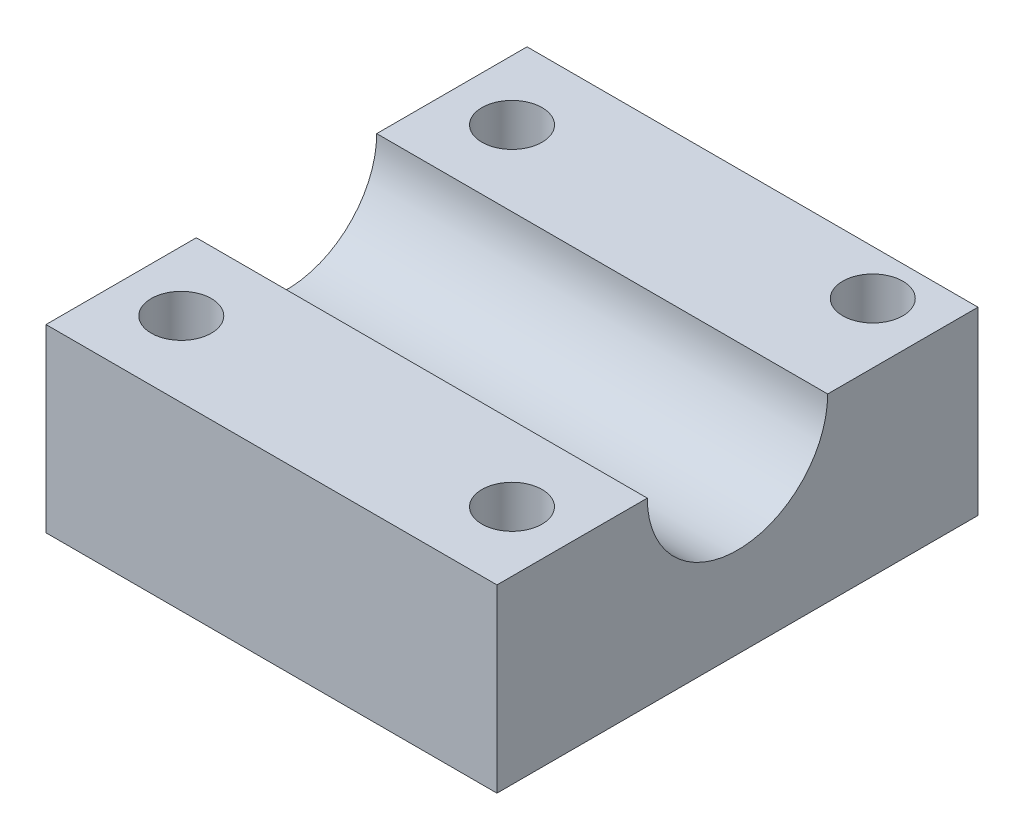
ISO-10303-21;
HEADER;
FILE_DESCRIPTION(('STEP AP214'),'2;1');
FILE_NAME('part.step','',(''),(''),'','','');
FILE_SCHEMA(('AUTOMOTIVE_DESIGN { 1 0 10303 214 1 1 1 1 }'));
ENDSEC;
DATA;
#1=APPLICATION_CONTEXT('core data for automotive mechanical design processes');
#2=APPLICATION_PROTOCOL_DEFINITION('international standard','automotive_design',2000,#1);
#3=PRODUCT_CONTEXT('',#1,'mechanical');
#4=PRODUCT('Part','Part','',(#3));
#5=PRODUCT_RELATED_PRODUCT_CATEGORY('part','',(#4));
#6=PRODUCT_DEFINITION_FORMATION('','',#4);
#7=PRODUCT_DEFINITION_CONTEXT('part definition',#1,'design');
#8=PRODUCT_DEFINITION('design','',#6,#7);
#9=PRODUCT_DEFINITION_SHAPE('','',#8);
#10=(LENGTH_UNIT() NAMED_UNIT(*) SI_UNIT(.MILLI.,.METRE.));
#11=(NAMED_UNIT(*) PLANE_ANGLE_UNIT() SI_UNIT($,.RADIAN.));
#12=(NAMED_UNIT(*) SI_UNIT($,.STERADIAN.) SOLID_ANGLE_UNIT());
#13=UNCERTAINTY_MEASURE_WITH_UNIT(LENGTH_MEASURE(1.E-05),#10,'distance_accuracy_value','');
#14=(GEOMETRIC_REPRESENTATION_CONTEXT(3) GLOBAL_UNCERTAINTY_ASSIGNED_CONTEXT((#13)) GLOBAL_UNIT_ASSIGNED_CONTEXT((#10,
#11,#12)) REPRESENTATION_CONTEXT('',''));
#15=CARTESIAN_POINT('',(0.,0.,0.));
#16=DIRECTION('',(0.,0.,1.));
#17=DIRECTION('',(1.,0.,0.));
#18=AXIS2_PLACEMENT_3D('',#15,#16,#17);
#19=CARTESIAN_POINT('',(30.,0.,0.));
#20=DIRECTION('',(0.,1.,0.));
#21=DIRECTION('',(0.,0.,1.));
#22=AXIS2_PLACEMENT_3D('',#19,#20,#21);
#23=PLANE('',#22);
#24=CARTESIAN_POINT('',(26.,0.,-5.));
#25=DIRECTION('',(0.,1.,0.));
#26=DIRECTION('',(0.,0.,1.));
#27=AXIS2_PLACEMENT_3D('',#24,#25,#26);
#28=CIRCLE('',#27,2.);
#29=CARTESIAN_POINT('',(26.,0.,-3.));
#30=VERTEX_POINT('',#29);
#31=EDGE_CURVE('E160',#30,#30,#28,.T.);
#32=ORIENTED_EDGE('',*,*,#31,.T.);
#33=EDGE_LOOP('',(#32));
#34=FACE_BOUND('',#33,.T.);
#35=CARTESIAN_POINT('',(4.,0.,-5.));
#36=DIRECTION('',(0.,1.,0.));
#37=DIRECTION('',(0.,0.,1.));
#38=AXIS2_PLACEMENT_3D('',#35,#36,#37);
#39=CIRCLE('',#38,2.);
#40=CARTESIAN_POINT('',(4.,0.,-3.));
#41=VERTEX_POINT('',#40);
#42=EDGE_CURVE('E164',#41,#41,#39,.T.);
#43=ORIENTED_EDGE('',*,*,#42,.T.);
#44=EDGE_LOOP('',(#43));
#45=FACE_BOUND('',#44,.T.);
#46=CARTESIAN_POINT('',(26.,0.,-29.));
#47=DIRECTION('',(0.,1.,0.));
#48=DIRECTION('',(0.,0.,1.));
#49=AXIS2_PLACEMENT_3D('',#46,#47,#48);
#50=CIRCLE('',#49,2.00000000000001);
#51=CARTESIAN_POINT('',(26.,0.,-27.));
#52=VERTEX_POINT('',#51);
#53=EDGE_CURVE('E168',#52,#52,#50,.T.);
#54=ORIENTED_EDGE('',*,*,#53,.T.);
#55=EDGE_LOOP('',(#54));
#56=FACE_BOUND('',#55,.T.);
#57=CARTESIAN_POINT('',(4.,0.,-27.));
#58=DIRECTION('',(0.,1.,0.));
#59=DIRECTION('',(0.,0.,1.));
#60=AXIS2_PLACEMENT_3D('',#57,#58,#59);
#61=CIRCLE('',#60,2.);
#62=CARTESIAN_POINT('',(4.,0.,-25.));
#63=VERTEX_POINT('',#62);
#64=EDGE_CURVE('E120',#63,#63,#61,.T.);
#65=ORIENTED_EDGE('',*,*,#64,.T.);
#66=EDGE_LOOP('',(#65));
#67=FACE_BOUND('',#66,.T.);
#68=DIRECTION('',(0.,0.,-1.));
#69=VECTOR('',#68,1.);
#70=CARTESIAN_POINT('',(0.,0.,0.));
#71=LINE('',#70,#69);
#72=CARTESIAN_POINT('',(0.,0.,0.));
#73=VERTEX_POINT('',#72);
#74=CARTESIAN_POINT('',(0.,0.,-32.));
#75=VERTEX_POINT('',#74);
#76=EDGE_CURVE('E116',#73,#75,#71,.T.);
#77=ORIENTED_EDGE('',*,*,#76,.T.);
#78=DIRECTION('',(-1.,0.,0.));
#79=VECTOR('',#78,1.);
#80=CARTESIAN_POINT('',(30.,0.,-32.));
#81=LINE('',#80,#79);
#82=CARTESIAN_POINT('',(30.,0.,-32.));
#83=VERTEX_POINT('',#82);
#84=EDGE_CURVE('E11',#83,#75,#81,.T.);
#85=ORIENTED_EDGE('',*,*,#84,.F.);
#86=DIRECTION('',(0.,0.,-1.));
#87=VECTOR('',#86,1.);
#88=CARTESIAN_POINT('',(30.,0.,0.));
#89=LINE('',#88,#87);
#90=CARTESIAN_POINT('',(30.,0.,0.));
#91=VERTEX_POINT('',#90);
#92=EDGE_CURVE('E127',#91,#83,#89,.T.);
#93=ORIENTED_EDGE('',*,*,#92,.F.);
#94=DIRECTION('',(-1.,0.,0.));
#95=VECTOR('',#94,1.);
#96=CARTESIAN_POINT('',(30.,0.,0.));
#97=LINE('',#96,#95);
#98=EDGE_CURVE('E112',#91,#73,#97,.T.);
#99=ORIENTED_EDGE('',*,*,#98,.T.);
#100=EDGE_LOOP('',(#77,#85,#93,#99));
#101=FACE_BOUND('',#100,.T.);
#102=ADVANCED_FACE('F32',(#34,#45,#56,#67,#101),#23,.F.);
#103=CARTESIAN_POINT('',(30.,0.,-32.));
#104=DIRECTION('',(0.,0.,1.));
#105=DIRECTION('',(1.,0.,0.));
#106=AXIS2_PLACEMENT_3D('',#103,#104,#105);
#107=PLANE('',#106);
#108=DIRECTION('',(0.,1.,0.));
#109=VECTOR('',#108,1.);
#110=CARTESIAN_POINT('',(0.,0.,-32.));
#111=LINE('',#110,#109);
#112=CARTESIAN_POINT('',(0.,12.,-32.));
#113=VERTEX_POINT('',#112);
#114=EDGE_CURVE('E119',#75,#113,#111,.T.);
#115=ORIENTED_EDGE('',*,*,#114,.T.);
#116=DIRECTION('',(-1.,0.,0.));
#117=VECTOR('',#116,1.);
#118=CARTESIAN_POINT('',(30.,12.,-32.));
#119=LINE('',#118,#117);
#120=CARTESIAN_POINT('',(30.,12.,-32.));
#121=VERTEX_POINT('',#120);
#122=EDGE_CURVE('E40',#121,#113,#119,.T.);
#123=ORIENTED_EDGE('',*,*,#122,.F.);
#124=DIRECTION('',(0.,1.,0.));
#125=VECTOR('',#124,1.);
#126=CARTESIAN_POINT('',(30.,0.,-32.));
#127=LINE('',#126,#125);
#128=EDGE_CURVE('E85',#83,#121,#127,.T.);
#129=ORIENTED_EDGE('',*,*,#128,.F.);
#130=ORIENTED_EDGE('',*,*,#84,.T.);
#131=EDGE_LOOP('',(#115,#123,#129,#130));
#132=FACE_BOUND('',#131,.T.);
#133=ADVANCED_FACE('F152',(#132),#107,.F.);
#134=CARTESIAN_POINT('',(30.,12.,-32.));
#135=DIRECTION('',(0.,-1.,0.));
#136=DIRECTION('',(0.,0.,-1.));
#137=AXIS2_PLACEMENT_3D('',#134,#135,#136);
#138=PLANE('',#137);
#139=CARTESIAN_POINT('',(26.,12.,-29.));
#140=DIRECTION('',(0.,1.,0.));
#141=DIRECTION('',(0.,0.,1.));
#142=AXIS2_PLACEMENT_3D('',#139,#140,#141);
#143=CIRCLE('',#142,2.00000000000001);
#144=CARTESIAN_POINT('',(26.,12.,-27.));
#145=VERTEX_POINT('',#144);
#146=EDGE_CURVE('E177',#145,#145,#143,.T.);
#147=ORIENTED_EDGE('',*,*,#146,.F.);
#148=EDGE_LOOP('',(#147));
#149=FACE_BOUND('',#148,.T.);
#150=CARTESIAN_POINT('',(4.,12.,-27.));
#151=DIRECTION('',(0.,1.,0.));
#152=DIRECTION('',(0.,0.,1.));
#153=AXIS2_PLACEMENT_3D('',#150,#151,#152);
#154=CIRCLE('',#153,2.);
#155=CARTESIAN_POINT('',(4.,12.,-25.));
#156=VERTEX_POINT('',#155);
#157=EDGE_CURVE('E172',#156,#156,#154,.T.);
#158=ORIENTED_EDGE('',*,*,#157,.F.);
#159=EDGE_LOOP('',(#158));
#160=FACE_BOUND('',#159,.T.);
#161=DIRECTION('',(0.,0.,1.));
#162=VECTOR('',#161,1.);
#163=CARTESIAN_POINT('',(0.,12.,-32.));
#164=LINE('',#163,#162);
#165=CARTESIAN_POINT('',(0.,12.,-22.));
#166=VERTEX_POINT('',#165);
#167=EDGE_CURVE('E122',#113,#166,#164,.T.);
#168=ORIENTED_EDGE('',*,*,#167,.T.);
#169=DIRECTION('',(-1.,0.,0.));
#170=VECTOR('',#169,1.);
#171=CARTESIAN_POINT('',(30.,12.,-22.));
#172=LINE('',#171,#170);
#173=CARTESIAN_POINT('',(30.,12.,-22.));
#174=VERTEX_POINT('',#173);
#175=EDGE_CURVE('E107',#174,#166,#172,.T.);
#176=ORIENTED_EDGE('',*,*,#175,.F.);
#177=DIRECTION('',(0.,0.,1.));
#178=VECTOR('',#177,1.);
#179=CARTESIAN_POINT('',(30.,12.,-32.));
#180=LINE('',#179,#178);
#181=EDGE_CURVE('E98',#121,#174,#180,.T.);
#182=ORIENTED_EDGE('',*,*,#181,.F.);
#183=ORIENTED_EDGE('',*,*,#122,.T.);
#184=EDGE_LOOP('',(#168,#176,#182,#183));
#185=FACE_BOUND('',#184,.T.);
#186=ADVANCED_FACE('F133',(#149,#160,#185),#138,.F.);
#187=CARTESIAN_POINT('',(30.,12.,-16.));
#188=DIRECTION('',(-1.,0.,0.));
#189=DIRECTION('',(0.,0.,1.));
#190=AXIS2_PLACEMENT_3D('',#187,#188,#189);
#191=CYLINDRICAL_SURFACE('',#190,6.);
#192=CARTESIAN_POINT('',(0.,12.,-16.));
#193=DIRECTION('',(-1.,0.,0.));
#194=DIRECTION('',(0.,0.,-1.));
#195=AXIS2_PLACEMENT_3D('',#192,#193,#194);
#196=CIRCLE('',#195,6.);
#197=CARTESIAN_POINT('',(0.,12.,-10.));
#198=VERTEX_POINT('',#197);
#199=EDGE_CURVE('E106',#166,#198,#196,.T.);
#200=ORIENTED_EDGE('',*,*,#199,.T.);
#201=DIRECTION('',(-1.,0.,0.));
#202=VECTOR('',#201,1.);
#203=CARTESIAN_POINT('',(30.,12.,-10.));
#204=LINE('',#203,#202);
#205=CARTESIAN_POINT('',(30.,12.,-10.));
#206=VERTEX_POINT('',#205);
#207=EDGE_CURVE('E103',#206,#198,#204,.T.);
#208=ORIENTED_EDGE('',*,*,#207,.F.);
#209=CARTESIAN_POINT('',(30.,12.,-16.));
#210=DIRECTION('',(-1.,0.,0.));
#211=DIRECTION('',(0.,0.,-1.));
#212=AXIS2_PLACEMENT_3D('',#209,#210,#211);
#213=CIRCLE('',#212,6.);
#214=EDGE_CURVE('E92',#174,#206,#213,.T.);
#215=ORIENTED_EDGE('',*,*,#214,.F.);
#216=ORIENTED_EDGE('',*,*,#175,.T.);
#217=EDGE_LOOP('',(#200,#208,#215,#216));
#218=FACE_BOUND('',#217,.T.);
#219=ADVANCED_FACE('F104',(#218),#191,.F.);
#220=CARTESIAN_POINT('',(30.,12.,0.));
#221=DIRECTION('',(0.,-1.,0.));
#222=DIRECTION('',(0.,0.,-1.));
#223=AXIS2_PLACEMENT_3D('',#220,#221,#222);
#224=PLANE('',#223);
#225=CARTESIAN_POINT('',(26.,12.,-5.));
#226=DIRECTION('',(0.,1.,0.));
#227=DIRECTION('',(0.,0.,1.));
#228=AXIS2_PLACEMENT_3D('',#225,#226,#227);
#229=CIRCLE('',#228,2.);
#230=CARTESIAN_POINT('',(26.,12.,-3.));
#231=VERTEX_POINT('',#230);
#232=EDGE_CURVE('E187',#231,#231,#229,.T.);
#233=ORIENTED_EDGE('',*,*,#232,.F.);
#234=EDGE_LOOP('',(#233));
#235=FACE_BOUND('',#234,.T.);
#236=CARTESIAN_POINT('',(4.,12.,-5.));
#237=DIRECTION('',(0.,1.,0.));
#238=DIRECTION('',(0.,0.,1.));
#239=AXIS2_PLACEMENT_3D('',#236,#237,#238);
#240=CIRCLE('',#239,2.);
#241=CARTESIAN_POINT('',(4.,12.,-3.));
#242=VERTEX_POINT('',#241);
#243=EDGE_CURVE('E183',#242,#242,#240,.T.);
#244=ORIENTED_EDGE('',*,*,#243,.F.);
#245=EDGE_LOOP('',(#244));
#246=FACE_BOUND('',#245,.T.);
#247=DIRECTION('',(0.,0.,1.));
#248=VECTOR('',#247,1.);
#249=CARTESIAN_POINT('',(0.,12.,0.));
#250=LINE('',#249,#248);
#251=CARTESIAN_POINT('',(0.,12.,0.));
#252=VERTEX_POINT('',#251);
#253=EDGE_CURVE('E71',#198,#252,#250,.T.);
#254=ORIENTED_EDGE('',*,*,#253,.T.);
#255=DIRECTION('',(-1.,0.,0.));
#256=VECTOR('',#255,1.);
#257=CARTESIAN_POINT('',(30.,12.,0.));
#258=LINE('',#257,#256);
#259=CARTESIAN_POINT('',(30.,12.,0.));
#260=VERTEX_POINT('',#259);
#261=EDGE_CURVE('E108',#260,#252,#258,.T.);
#262=ORIENTED_EDGE('',*,*,#261,.F.);
#263=DIRECTION('',(0.,0.,1.));
#264=VECTOR('',#263,1.);
#265=CARTESIAN_POINT('',(30.,12.,0.));
#266=LINE('',#265,#264);
#267=EDGE_CURVE('E96',#206,#260,#266,.T.);
#268=ORIENTED_EDGE('',*,*,#267,.F.);
#269=ORIENTED_EDGE('',*,*,#207,.T.);
#270=EDGE_LOOP('',(#254,#262,#268,#269));
#271=FACE_BOUND('',#270,.T.);
#272=ADVANCED_FACE('F110',(#235,#246,#271),#224,.F.);
#273=CARTESIAN_POINT('',(30.,0.,0.));
#274=DIRECTION('',(0.,0.,-1.));
#275=DIRECTION('',(-1.,0.,0.));
#276=AXIS2_PLACEMENT_3D('',#273,#274,#275);
#277=PLANE('',#276);
#278=DIRECTION('',(0.,-1.,0.));
#279=VECTOR('',#278,1.);
#280=CARTESIAN_POINT('',(0.,0.,0.));
#281=LINE('',#280,#279);
#282=EDGE_CURVE('E77',#252,#73,#281,.T.);
#283=ORIENTED_EDGE('',*,*,#282,.T.);
#284=ORIENTED_EDGE('',*,*,#98,.F.);
#285=DIRECTION('',(0.,-1.,0.));
#286=VECTOR('',#285,1.);
#287=CARTESIAN_POINT('',(30.,0.,0.));
#288=LINE('',#287,#286);
#289=EDGE_CURVE('E48',#260,#91,#288,.T.);
#290=ORIENTED_EDGE('',*,*,#289,.F.);
#291=ORIENTED_EDGE('',*,*,#261,.T.);
#292=EDGE_LOOP('',(#283,#284,#290,#291));
#293=FACE_BOUND('',#292,.T.);
#294=ADVANCED_FACE('F140',(#293),#277,.F.);
#295=CARTESIAN_POINT('',(30.,12.,-16.));
#296=DIRECTION('',(1.,0.,0.));
#297=DIRECTION('',(0.,0.,-1.));
#298=AXIS2_PLACEMENT_3D('',#295,#296,#297);
#299=PLANE('',#298);
#300=ORIENTED_EDGE('',*,*,#92,.T.);
#301=ORIENTED_EDGE('',*,*,#128,.T.);
#302=ORIENTED_EDGE('',*,*,#181,.T.);
#303=ORIENTED_EDGE('',*,*,#214,.T.);
#304=ORIENTED_EDGE('',*,*,#267,.T.);
#305=ORIENTED_EDGE('',*,*,#289,.T.);
#306=EDGE_LOOP('',(#300,#301,#302,#303,#304,#305));
#307=FACE_BOUND('',#306,.T.);
#308=ADVANCED_FACE('F94',(#307),#299,.T.);
#309=CARTESIAN_POINT('',(0.,12.,-16.));
#310=DIRECTION('',(1.,0.,0.));
#311=DIRECTION('',(0.,0.,-1.));
#312=AXIS2_PLACEMENT_3D('',#309,#310,#311);
#313=PLANE('',#312);
#314=ORIENTED_EDGE('',*,*,#76,.F.);
#315=ORIENTED_EDGE('',*,*,#282,.F.);
#316=ORIENTED_EDGE('',*,*,#253,.F.);
#317=ORIENTED_EDGE('',*,*,#199,.F.);
#318=ORIENTED_EDGE('',*,*,#167,.F.);
#319=ORIENTED_EDGE('',*,*,#114,.F.);
#320=EDGE_LOOP('',(#314,#315,#316,#317,#318,#319));
#321=FACE_BOUND('',#320,.T.);
#322=ADVANCED_FACE('F136',(#321),#313,.F.);
#323=CARTESIAN_POINT('',(4.,0.,-27.));
#324=DIRECTION('',(0.,1.,0.));
#325=DIRECTION('',(0.,0.,1.));
#326=AXIS2_PLACEMENT_3D('',#323,#324,#325);
#327=CYLINDRICAL_SURFACE('',#326,2.);
#328=ORIENTED_EDGE('',*,*,#64,.F.);
#329=EDGE_LOOP('',(#328));
#330=FACE_BOUND('',#329,.T.);
#331=ORIENTED_EDGE('',*,*,#157,.T.);
#332=EDGE_LOOP('',(#331));
#333=FACE_BOUND('',#332,.T.);
#334=ADVANCED_FACE('F207',(#330,#333),#327,.F.);
#335=CARTESIAN_POINT('',(26.,0.,-29.));
#336=DIRECTION('',(0.,1.,0.));
#337=DIRECTION('',(0.,0.,1.));
#338=AXIS2_PLACEMENT_3D('',#335,#336,#337);
#339=CYLINDRICAL_SURFACE('',#338,2.00000000000001);
#340=ORIENTED_EDGE('',*,*,#53,.F.);
#341=EDGE_LOOP('',(#340));
#342=FACE_BOUND('',#341,.T.);
#343=ORIENTED_EDGE('',*,*,#146,.T.);
#344=EDGE_LOOP('',(#343));
#345=FACE_BOUND('',#344,.T.);
#346=ADVANCED_FACE('F198',(#342,#345),#339,.F.);
#347=CARTESIAN_POINT('',(4.,0.,-5.));
#348=DIRECTION('',(0.,1.,0.));
#349=DIRECTION('',(0.,0.,1.));
#350=AXIS2_PLACEMENT_3D('',#347,#348,#349);
#351=CYLINDRICAL_SURFACE('',#350,2.);
#352=ORIENTED_EDGE('',*,*,#42,.F.);
#353=EDGE_LOOP('',(#352));
#354=FACE_BOUND('',#353,.T.);
#355=ORIENTED_EDGE('',*,*,#243,.T.);
#356=EDGE_LOOP('',(#355));
#357=FACE_BOUND('',#356,.T.);
#358=ADVANCED_FACE('F196',(#354,#357),#351,.F.);
#359=CARTESIAN_POINT('',(26.,0.,-5.));
#360=DIRECTION('',(0.,1.,0.));
#361=DIRECTION('',(0.,0.,1.));
#362=AXIS2_PLACEMENT_3D('',#359,#360,#361);
#363=CYLINDRICAL_SURFACE('',#362,2.);
#364=ORIENTED_EDGE('',*,*,#31,.F.);
#365=EDGE_LOOP('',(#364));
#366=FACE_BOUND('',#365,.T.);
#367=ORIENTED_EDGE('',*,*,#232,.T.);
#368=EDGE_LOOP('',(#367));
#369=FACE_BOUND('',#368,.T.);
#370=ADVANCED_FACE('F192',(#366,#369),#363,.F.);
#371=CLOSED_SHELL('',(#102,#133,#186,#219,#272,#294,#308,#322,#334,#346,#358,#370));
#372=MANIFOLD_SOLID_BREP('B2',#371);
#373=ADVANCED_BREP_SHAPE_REPRESENTATION('',(#18,#372),#14);
#374=SHAPE_DEFINITION_REPRESENTATION(#9,#373);
ENDSEC;
END-ISO-10303-21;
